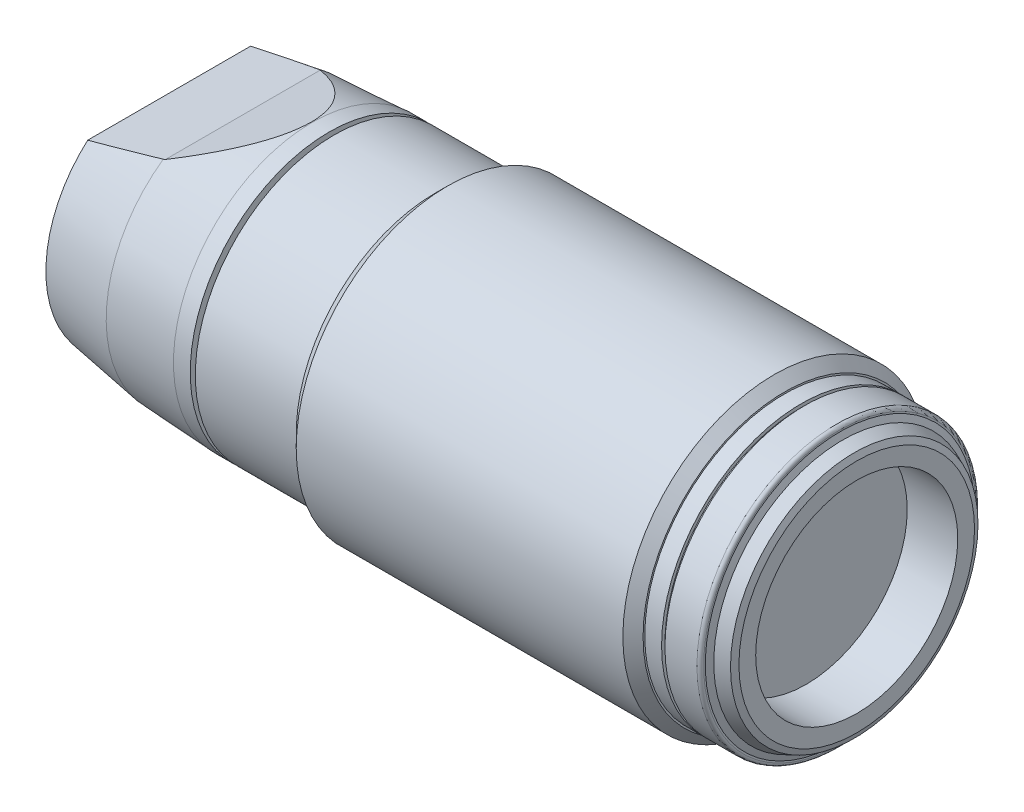
ISO-10303-21;
HEADER;
FILE_DESCRIPTION(('STEP AP214'),'2;1');
FILE_NAME('part.step','',(''),(''),'','','');
FILE_SCHEMA(('AUTOMOTIVE_DESIGN { 1 0 10303 214 1 1 1 1 }'));
ENDSEC;
DATA;
#1=APPLICATION_CONTEXT('core data for automotive mechanical design processes');
#2=APPLICATION_PROTOCOL_DEFINITION('international standard','automotive_design',2000,#1);
#3=PRODUCT_CONTEXT('',#1,'mechanical');
#4=PRODUCT('Part','Part','',(#3));
#5=PRODUCT_RELATED_PRODUCT_CATEGORY('part','',(#4));
#6=PRODUCT_DEFINITION_FORMATION('','',#4);
#7=PRODUCT_DEFINITION_CONTEXT('part definition',#1,'design');
#8=PRODUCT_DEFINITION('design','',#6,#7);
#9=PRODUCT_DEFINITION_SHAPE('','',#8);
#10=(LENGTH_UNIT() NAMED_UNIT(*) SI_UNIT(.MILLI.,.METRE.));
#11=(NAMED_UNIT(*) PLANE_ANGLE_UNIT() SI_UNIT($,.RADIAN.));
#12=(NAMED_UNIT(*) SI_UNIT($,.STERADIAN.) SOLID_ANGLE_UNIT());
#13=UNCERTAINTY_MEASURE_WITH_UNIT(LENGTH_MEASURE(1.E-05),#10,'distance_accuracy_value','');
#14=(GEOMETRIC_REPRESENTATION_CONTEXT(3) GLOBAL_UNCERTAINTY_ASSIGNED_CONTEXT((#13)) GLOBAL_UNIT_ASSIGNED_CONTEXT((#10,
#11,#12)) REPRESENTATION_CONTEXT('',''));
#15=CARTESIAN_POINT('',(0.,0.,0.));
#16=DIRECTION('',(0.,0.,1.));
#17=DIRECTION('',(1.,0.,0.));
#18=AXIS2_PLACEMENT_3D('',#15,#16,#17);
#19=CARTESIAN_POINT('',(-55.1010169868501,8.23905026673058,0.));
#20=DIRECTION('',(-1.,0.,0.));
#21=DIRECTION('',(0.,0.,1.));
#22=AXIS2_PLACEMENT_3D('',#19,#20,#21);
#23=PLANE('',#22);
#24=CARTESIAN_POINT('',(-55.1010169868501,0.,0.));
#25=DIRECTION('',(-1.,0.,0.));
#26=DIRECTION('',(0.,1.,0.));
#27=AXIS2_PLACEMENT_3D('',#24,#25,#26);
#28=CIRCLE('',#27,8.23340708161636);
#29=CARTESIAN_POINT('',(-55.1010169868501,8.23340708161636,0.));
#30=VERTEX_POINT('',#29);
#31=EDGE_CURVE('E174',#30,#30,#28,.T.);
#32=ORIENTED_EDGE('',*,*,#31,.F.);
#33=EDGE_LOOP('',(#32));
#34=FACE_BOUND('',#33,.T.);
#35=CARTESIAN_POINT('',(-55.1010169868501,0.,0.));
#36=DIRECTION('',(-1.,0.,0.));
#37=DIRECTION('',(0.,1.,0.));
#38=AXIS2_PLACEMENT_3D('',#35,#36,#37);
#39=CIRCLE('',#38,8.2446934518448);
#40=CARTESIAN_POINT('',(-55.1010169868501,8.2446934518448,0.));
#41=VERTEX_POINT('',#40);
#42=EDGE_CURVE('E206',#41,#41,#39,.T.);
#43=ORIENTED_EDGE('',*,*,#42,.T.);
#44=EDGE_LOOP('',(#43));
#45=FACE_BOUND('',#44,.T.);
#46=ADVANCED_FACE('F47',(#34,#45),#23,.T.);
#47=CARTESIAN_POINT('',(-54.1040542833416,7.84402730873667,0.));
#48=DIRECTION('',(1.,0.,0.));
#49=DIRECTION('',(0.,0.,1.));
#50=AXIS2_PLACEMENT_3D('',#47,#48,#49);
#51=PLANE('',#50);
#52=CARTESIAN_POINT('',(-54.1040542833416,0.,0.));
#53=DIRECTION('',(-1.,0.,0.));
#54=DIRECTION('',(0.,1.,0.));
#55=AXIS2_PLACEMENT_3D('',#52,#53,#54);
#56=CIRCLE('',#55,7.44336116562853);
#57=CARTESIAN_POINT('',(-54.1040542833416,7.44336116562853,0.));
#58=VERTEX_POINT('',#57);
#59=EDGE_CURVE('E173',#58,#58,#56,.T.);
#60=ORIENTED_EDGE('',*,*,#59,.T.);
#61=EDGE_LOOP('',(#60));
#62=FACE_BOUND('',#61,.T.);
#63=CARTESIAN_POINT('',(-54.1040542833416,0.,0.));
#64=DIRECTION('',(-1.,0.,0.));
#65=DIRECTION('',(0.,1.,0.));
#66=AXIS2_PLACEMENT_3D('',#63,#64,#65);
#67=CIRCLE('',#66,8.24469345184481);
#68=CARTESIAN_POINT('',(-54.1040542833416,8.24469345184481,0.));
#69=VERTEX_POINT('',#68);
#70=EDGE_CURVE('E193',#69,#69,#67,.T.);
#71=ORIENTED_EDGE('',*,*,#70,.F.);
#72=EDGE_LOOP('',(#71));
#73=FACE_BOUND('',#72,.T.);
#74=ADVANCED_FACE('F273',(#62,#73),#51,.T.);
#75=CARTESIAN_POINT('',(-53.8030844105843,7.84402730873668,0.));
#76=DIRECTION('',(-1.,0.,0.));
#77=DIRECTION('',(0.,0.,1.));
#78=AXIS2_PLACEMENT_3D('',#75,#76,#77);
#79=PLANE('',#78);
#80=CARTESIAN_POINT('',(-53.8030844105843,0.,0.));
#81=DIRECTION('',(-1.,0.,0.));
#82=DIRECTION('',(0.,1.,0.));
#83=AXIS2_PLACEMENT_3D('',#80,#81,#82);
#84=CIRCLE('',#83,7.44336116562856);
#85=CARTESIAN_POINT('',(-53.8030844105843,7.44336116562856,0.));
#86=VERTEX_POINT('',#85);
#87=EDGE_CURVE('E168',#86,#86,#84,.T.);
#88=ORIENTED_EDGE('',*,*,#87,.F.);
#89=EDGE_LOOP('',(#88));
#90=FACE_BOUND('',#89,.T.);
#91=CARTESIAN_POINT('',(-53.8030844105843,0.,0.));
#92=DIRECTION('',(-1.,0.,0.));
#93=DIRECTION('',(0.,1.,0.));
#94=AXIS2_PLACEMENT_3D('',#91,#92,#93);
#95=CIRCLE('',#94,8.24469345184481);
#96=CARTESIAN_POINT('',(-53.8030844105843,8.24469345184481,0.));
#97=VERTEX_POINT('',#96);
#98=EDGE_CURVE('E132',#97,#97,#95,.T.);
#99=ORIENTED_EDGE('',*,*,#98,.T.);
#100=EDGE_LOOP('',(#99));
#101=FACE_BOUND('',#100,.T.);
#102=ADVANCED_FACE('F279',(#90,#101),#79,.T.);
#103=CARTESIAN_POINT('',(-57.1622095161336,7.41087092652197,10.));
#104=DIRECTION('',(0.37845529282286,-0.925619571602915,0.));
#105=DIRECTION('',(0.,0.,-1.));
#106=AXIS2_PLACEMENT_3D('',#103,#104,#105);
#107=PLANE('',#106);
#108=CARTESIAN_POINT('',(-72.9605562151176,0.951448384572951,0.));
#109=DIRECTION('',(0.37845529282286,-0.925619571602915,0.));
#110=DIRECTION('',(-0.925619571602915,-0.37845529282286,0.));
#111=AXIS2_PLACEMENT_3D('',#108,#109,#110);
#112=ELLIPSE('',#111,19.2332325140927,7.21646745878138);
#113=CARTESIAN_POINT('',(-59.2273599823166,6.56649906103829,-4.59209156186527));
#114=VERTEX_POINT('',#113);
#115=CARTESIAN_POINT('',(-59.2273599823166,6.56649906103829,4.59209156186525));
#116=VERTEX_POINT('',#115);
#117=EDGE_CURVE('E109',#114,#116,#112,.T.);
#118=ORIENTED_EDGE('',*,*,#117,.F.);
#119=DIRECTION('',(0.,0.,-1.));
#120=VECTOR('',#119,1.);
#121=CARTESIAN_POINT('',(-59.2273599823166,6.56649906103829,10.));
#122=LINE('',#121,#120);
#123=EDGE_CURVE('E62',#116,#114,#122,.T.);
#124=ORIENTED_EDGE('',*,*,#123,.F.);
#125=EDGE_LOOP('',(#118,#124));
#126=FACE_BOUND('',#125,.T.);
#127=ADVANCED_FACE('F369',(#126),#107,.F.);
#128=CARTESIAN_POINT('',(-61.4136799911583,6.03081221244753,10.));
#129=DIRECTION('',(0.237978342728003,-0.971270460990363,0.));
#130=DIRECTION('',(0.,0.,-1.));
#131=AXIS2_PLACEMENT_3D('',#128,#129,#130);
#132=PLANE('',#131);
#133=CARTESIAN_POINT('',(-68.5403511127206,4.28465246519486,0.));
#134=DIRECTION('',(0.237978342728003,-0.971270460990363,0.));
#135=DIRECTION('',(-0.971270460990363,-0.237978342728003,0.));
#136=AXIS2_PLACEMENT_3D('',#133,#134,#135);
#137=ELLIPSE('',#136,27.4230416701056,4.92256072190537);
#138=CARTESIAN_POINT('',(-59.3329283602861,6.54063295201645,4.61908537341161));
#139=VERTEX_POINT('',#138);
#140=CARTESIAN_POINT('',(-63.6,5.49512536385674,4.83714268892134));
#141=VERTEX_POINT('',#140);
#142=EDGE_CURVE('E98',#139,#141,#137,.T.);
#143=ORIENTED_EDGE('',*,*,#142,.F.);
#144=CARTESIAN_POINT('',(-79.8765561836852,1.5070828757088,0.));
#145=DIRECTION('',(0.237978342728004,-0.971270460990363,0.));
#146=DIRECTION('',(-0.971270460990363,-0.237978342728004,0.));
#147=AXIS2_PLACEMENT_3D('',#144,#145,#146);
#148=ELLIPSE('',#147,29.0333087163899,6.74293034401905);
#149=EDGE_CURVE('E176',#116,#139,#148,.T.);
#150=ORIENTED_EDGE('',*,*,#149,.F.);
#151=ORIENTED_EDGE('',*,*,#123,.T.);
#152=CARTESIAN_POINT('',(-79.8765561836852,1.5070828757088,0.));
#153=DIRECTION('',(0.237978342728004,-0.971270460990363,0.));
#154=DIRECTION('',(-0.971270460990363,-0.237978342728004,0.));
#155=AXIS2_PLACEMENT_3D('',#152,#153,#154);
#156=ELLIPSE('',#155,29.0333087163899,6.74293034401905);
#157=CARTESIAN_POINT('',(-59.3329283602861,6.54063295201645,-4.61908537341163));
#158=VERTEX_POINT('',#157);
#159=EDGE_CURVE('E91',#158,#114,#156,.T.);
#160=ORIENTED_EDGE('',*,*,#159,.F.);
#161=CARTESIAN_POINT('',(-68.5403511127206,4.28465246519486,0.));
#162=DIRECTION('',(0.237978342728003,-0.971270460990363,0.));
#163=DIRECTION('',(-0.971270460990363,-0.237978342728003,0.));
#164=AXIS2_PLACEMENT_3D('',#161,#162,#163);
#165=ELLIPSE('',#164,27.4230416701056,4.92256072190537);
#166=CARTESIAN_POINT('',(-63.6,5.49512536385674,-4.83714268892136));
#167=VERTEX_POINT('',#166);
#168=EDGE_CURVE('E88',#167,#158,#165,.T.);
#169=ORIENTED_EDGE('',*,*,#168,.F.);
#170=DIRECTION('',(0.,0.,-1.));
#171=VECTOR('',#170,1.);
#172=CARTESIAN_POINT('',(-63.6,5.49512536385674,10.));
#173=LINE('',#172,#171);
#174=EDGE_CURVE('E77',#141,#167,#173,.T.);
#175=ORIENTED_EDGE('',*,*,#174,.F.);
#176=EDGE_LOOP('',(#143,#150,#151,#160,#169,#175));
#177=FACE_BOUND('',#176,.T.);
#178=ADVANCED_FACE('F89',(#177),#132,.F.);
#179=CARTESIAN_POINT('',(-63.6,2.74756268192837,10.));
#180=DIRECTION('',(1.,0.,0.));
#181=DIRECTION('',(0.,0.,1.));
#182=AXIS2_PLACEMENT_3D('',#179,#180,#181);
#183=PLANE('',#182);
#184=CARTESIAN_POINT('',(-63.6,0.,0.));
#185=DIRECTION('',(1.,0.,0.));
#186=DIRECTION('',(0.,1.,0.));
#187=AXIS2_PLACEMENT_3D('',#184,#185,#186);
#188=CIRCLE('',#187,7.32081635867797);
#189=EDGE_CURVE('E81',#141,#167,#188,.T.);
#190=ORIENTED_EDGE('',*,*,#189,.F.);
#191=ORIENTED_EDGE('',*,*,#174,.T.);
#192=EDGE_LOOP('',(#190,#191));
#193=FACE_BOUND('',#192,.T.);
#194=ADVANCED_FACE('F79',(#193),#183,.F.);
#195=CARTESIAN_POINT('',(-47.4356905400631,0.,0.));
#196=DIRECTION('',(1.,0.,0.));
#197=DIRECTION('',(0.,1.,0.));
#198=AXIS2_PLACEMENT_3D('',#195,#196,#197);
#199=CONICAL_SURFACE('',#198,8.61902473108667,0.785398163397409);
#200=CARTESIAN_POINT('',(-47.0613592608212,0.,0.));
#201=DIRECTION('',(1.,0.,0.));
#202=DIRECTION('',(0.,0.,-1.));
#203=AXIS2_PLACEMENT_3D('',#200,#201,#202);
#204=CIRCLE('',#203,8.99335601032853);
#205=CARTESIAN_POINT('',(-47.0613592608212,0.,-8.99335601032854));
#206=VERTEX_POINT('',#205);
#207=EDGE_CURVE('E221',#206,#206,#204,.T.);
#208=ORIENTED_EDGE('',*,*,#207,.F.);
#209=EDGE_LOOP('',(#208));
#210=FACE_BOUND('',#209,.T.);
#211=CARTESIAN_POINT('',(-47.810021819305,0.,0.));
#212=DIRECTION('',(-1.,0.,0.));
#213=DIRECTION('',(0.,1.,0.));
#214=AXIS2_PLACEMENT_3D('',#211,#212,#213);
#215=CIRCLE('',#214,8.24469345184481);
#216=CARTESIAN_POINT('',(-47.810021819305,8.24469345184481,0.));
#217=VERTEX_POINT('',#216);
#218=EDGE_CURVE('E86',#217,#217,#215,.T.);
#219=ORIENTED_EDGE('',*,*,#218,.F.);
#220=EDGE_LOOP('',(#219));
#221=FACE_BOUND('',#220,.T.);
#222=ADVANCED_FACE('F378',(#210,#221),#199,.T.);
#223=CARTESIAN_POINT('',(-50.8065531149446,0.,0.));
#224=DIRECTION('',(-1.,0.,0.));
#225=DIRECTION('',(0.,1.,0.));
#226=AXIS2_PLACEMENT_3D('',#223,#224,#225);
#227=CYLINDRICAL_SURFACE('',#226,8.24469345184481);
#228=ORIENTED_EDGE('',*,*,#218,.T.);
#229=EDGE_LOOP('',(#228));
#230=FACE_BOUND('',#229,.T.);
#231=ORIENTED_EDGE('',*,*,#98,.F.);
#232=EDGE_LOOP('',(#231));
#233=FACE_BOUND('',#232,.T.);
#234=ADVANCED_FACE('F286',(#230,#233),#227,.T.);
#235=CARTESIAN_POINT('',(-53.953569346963,0.,0.));
#236=DIRECTION('',(-1.,0.,0.));
#237=DIRECTION('',(0.,1.,0.));
#238=AXIS2_PLACEMENT_3D('',#235,#236,#237);
#239=CYLINDRICAL_SURFACE('',#238,7.44336116562855);
#240=ORIENTED_EDGE('',*,*,#87,.T.);
#241=EDGE_LOOP('',(#240));
#242=FACE_BOUND('',#241,.T.);
#243=ORIENTED_EDGE('',*,*,#59,.F.);
#244=EDGE_LOOP('',(#243));
#245=FACE_BOUND('',#244,.T.);
#246=ADVANCED_FACE('F365',(#242,#245),#239,.T.);
#247=CARTESIAN_POINT('',(-54.6025356350959,0.,0.));
#248=DIRECTION('',(-1.,0.,0.));
#249=DIRECTION('',(0.,1.,0.));
#250=AXIS2_PLACEMENT_3D('',#247,#248,#249);
#251=CYLINDRICAL_SURFACE('',#250,8.2446934518448);
#252=ORIENTED_EDGE('',*,*,#70,.T.);
#253=EDGE_LOOP('',(#252));
#254=FACE_BOUND('',#253,.T.);
#255=ORIENTED_EDGE('',*,*,#42,.F.);
#256=EDGE_LOOP('',(#255));
#257=FACE_BOUND('',#256,.T.);
#258=ADVANCED_FACE('F360',(#254,#257),#251,.T.);
#259=CARTESIAN_POINT('',(-57.2169726735681,0.,0.));
#260=DIRECTION('',(1.,0.,0.));
#261=DIRECTION('',(0.,1.,0.));
#262=AXIS2_PLACEMENT_3D('',#259,#260,#261);
#263=CONICAL_SURFACE('',#262,8.12032156391767,0.0533933836925066);
#264=ORIENTED_EDGE('',*,*,#31,.T.);
#265=EDGE_LOOP('',(#264));
#266=FACE_BOUND('',#265,.T.);
#267=CARTESIAN_POINT('',(-59.3329283602861,0.,0.));
#268=DIRECTION('',(-1.,0.,0.));
#269=DIRECTION('',(0.,1.,0.));
#270=AXIS2_PLACEMENT_3D('',#267,#268,#269);
#271=CIRCLE('',#270,8.00723604621898);
#272=EDGE_CURVE('E104',#158,#139,#271,.T.);
#273=ORIENTED_EDGE('',*,*,#272,.F.);
#274=ORIENTED_EDGE('',*,*,#159,.T.);
#275=ORIENTED_EDGE('',*,*,#117,.T.);
#276=ORIENTED_EDGE('',*,*,#149,.T.);
#277=EDGE_LOOP('',(#273,#274,#275,#276));
#278=FACE_BOUND('',#277,.T.);
#279=ADVANCED_FACE('F358',(#266,#278),#263,.T.);
#280=CARTESIAN_POINT('',(-61.4664751275351,0.,0.));
#281=DIRECTION('',(1.,0.,0.));
#282=DIRECTION('',(0.,1.,0.));
#283=AXIS2_PLACEMENT_3D('',#280,#281,#282);
#284=CONICAL_SURFACE('',#283,7.66402444140342,0.159497919165924);
#285=ORIENTED_EDGE('',*,*,#272,.T.);
#286=ORIENTED_EDGE('',*,*,#142,.T.);
#287=ORIENTED_EDGE('',*,*,#189,.T.);
#288=ORIENTED_EDGE('',*,*,#168,.T.);
#289=EDGE_LOOP('',(#285,#286,#287,#288));
#290=FACE_BOUND('',#289,.T.);
#291=ADVANCED_FACE('F97',(#290),#284,.T.);
#292=CARTESIAN_POINT('',(-27.0613592608212,0.,0.));
#293=DIRECTION('',(-1.,0.,0.));
#294=DIRECTION('',(0.,0.,1.));
#295=AXIS2_PLACEMENT_3D('',#292,#293,#294);
#296=CYLINDRICAL_SURFACE('',#295,8.99335601032853);
#297=CARTESIAN_POINT('',(-27.6632990063358,0.,0.));
#298=DIRECTION('',(1.,0.,0.));
#299=DIRECTION('',(0.,0.,-1.));
#300=AXIS2_PLACEMENT_3D('',#297,#298,#299);
#301=CIRCLE('',#300,8.99335601032853);
#302=CARTESIAN_POINT('',(-27.6632990063358,0.,-8.99335601032853));
#303=VERTEX_POINT('',#302);
#304=EDGE_CURVE('E310',#303,#303,#301,.F.);
#305=ORIENTED_EDGE('',*,*,#304,.T.);
#306=EDGE_LOOP('',(#305));
#307=FACE_BOUND('',#306,.T.);
#308=ORIENTED_EDGE('',*,*,#207,.T.);
#309=EDGE_LOOP('',(#308));
#310=FACE_BOUND('',#309,.T.);
#311=ADVANCED_FACE('F353',(#307,#310),#296,.T.);
#312=CARTESIAN_POINT('',(-27.0613592608212,0.,0.));
#313=DIRECTION('',(1.,0.,0.));
#314=DIRECTION('',(0.,0.,-1.));
#315=AXIS2_PLACEMENT_3D('',#312,#313,#314);
#316=PLANE('',#315);
#317=CARTESIAN_POINT('',(-27.0613592608212,0.,0.));
#318=DIRECTION('',(1.,0.,0.));
#319=DIRECTION('',(0.,0.,-1.));
#320=AXIS2_PLACEMENT_3D('',#317,#318,#319);
#321=CIRCLE('',#320,8.39517838822345);
#322=CARTESIAN_POINT('',(-27.0613592608212,0.,-8.39517838822345));
#323=VERTEX_POINT('',#322);
#324=EDGE_CURVE('E208',#323,#323,#321,.T.);
#325=ORIENTED_EDGE('',*,*,#324,.T.);
#326=EDGE_LOOP('',(#325));
#327=FACE_BOUND('',#326,.T.);
#328=CARTESIAN_POINT('',(-27.0613592608212,0.,0.));
#329=DIRECTION('',(1.,0.,0.));
#330=DIRECTION('',(0.,0.,-1.));
#331=AXIS2_PLACEMENT_3D('',#328,#329,#330);
#332=CIRCLE('',#331,8.29360105616787);
#333=CARTESIAN_POINT('',(-27.0613592608212,0.,-8.29360105616787));
#334=VERTEX_POINT('',#333);
#335=EDGE_CURVE('E227',#334,#334,#332,.T.);
#336=ORIENTED_EDGE('',*,*,#335,.F.);
#337=EDGE_LOOP('',(#336));
#338=FACE_BOUND('',#337,.T.);
#339=ADVANCED_FACE('F349',(#327,#338),#316,.T.);
#340=CARTESIAN_POINT('',(-26.0643965573127,0.,0.));
#341=DIRECTION('',(-1.,0.,0.));
#342=DIRECTION('',(0.,0.,1.));
#343=AXIS2_PLACEMENT_3D('',#340,#341,#342);
#344=CYLINDRICAL_SURFACE('',#343,8.29360105616787);
#345=CARTESIAN_POINT('',(-26.0643965573127,0.,0.));
#346=DIRECTION('',(1.,0.,0.));
#347=DIRECTION('',(0.,0.,-1.));
#348=AXIS2_PLACEMENT_3D('',#345,#346,#347);
#349=CIRCLE('',#348,8.29360105616787);
#350=CARTESIAN_POINT('',(-26.0643965573127,0.,-8.29360105616787));
#351=VERTEX_POINT('',#350);
#352=EDGE_CURVE('E226',#351,#351,#349,.T.);
#353=ORIENTED_EDGE('',*,*,#352,.F.);
#354=EDGE_LOOP('',(#353));
#355=FACE_BOUND('',#354,.T.);
#356=ORIENTED_EDGE('',*,*,#335,.T.);
#357=EDGE_LOOP('',(#356));
#358=FACE_BOUND('',#357,.T.);
#359=ADVANCED_FACE('F345',(#355,#358),#344,.T.);
#360=CARTESIAN_POINT('',(-26.0643965573127,0.,0.));
#361=DIRECTION('',(1.,0.,0.));
#362=DIRECTION('',(0.,0.,-1.));
#363=AXIS2_PLACEMENT_3D('',#360,#361,#362);
#364=PLANE('',#363);
#365=CARTESIAN_POINT('',(-26.0643965573127,0.,0.));
#366=DIRECTION('',(1.,0.,0.));
#367=DIRECTION('',(0.,0.,-1.));
#368=AXIS2_PLACEMENT_3D('',#365,#366,#367);
#369=CIRCLE('',#368,8.09420851546615);
#370=CARTESIAN_POINT('',(-26.0643965573127,0.,-8.09420851546615));
#371=VERTEX_POINT('',#370);
#372=EDGE_CURVE('E230',#371,#371,#369,.T.);
#373=ORIENTED_EDGE('',*,*,#372,.F.);
#374=EDGE_LOOP('',(#373));
#375=FACE_BOUND('',#374,.T.);
#376=ORIENTED_EDGE('',*,*,#352,.T.);
#377=EDGE_LOOP('',(#376));
#378=FACE_BOUND('',#377,.T.);
#379=ADVANCED_FACE('F341',(#375,#378),#364,.T.);
#380=CARTESIAN_POINT('',(-25.865004016611,0.,0.));
#381=DIRECTION('',(-1.,0.,0.));
#382=DIRECTION('',(0.,0.,1.));
#383=AXIS2_PLACEMENT_3D('',#380,#381,#382);
#384=CYLINDRICAL_SURFACE('',#383,8.09420851546615);
#385=CARTESIAN_POINT('',(-25.865004016611,0.,0.));
#386=DIRECTION('',(1.,0.,0.));
#387=DIRECTION('',(0.,0.,-1.));
#388=AXIS2_PLACEMENT_3D('',#385,#386,#387);
#389=CIRCLE('',#388,8.09420851546615);
#390=CARTESIAN_POINT('',(-25.865004016611,0.,-8.09420851546615));
#391=VERTEX_POINT('',#390);
#392=EDGE_CURVE('E233',#391,#391,#389,.T.);
#393=ORIENTED_EDGE('',*,*,#392,.F.);
#394=EDGE_LOOP('',(#393));
#395=FACE_BOUND('',#394,.T.);
#396=ORIENTED_EDGE('',*,*,#372,.T.);
#397=EDGE_LOOP('',(#396));
#398=FACE_BOUND('',#397,.T.);
#399=ADVANCED_FACE('F322',(#395,#398),#384,.T.);
#400=CARTESIAN_POINT('',(-23.765739154129,0.,0.));
#401=DIRECTION('',(-1.,0.,0.));
#402=DIRECTION('',(0.,0.,1.));
#403=AXIS2_PLACEMENT_3D('',#400,#401,#402);
#404=CYLINDRICAL_SURFACE('',#403,8.29360105616787);
#405=CARTESIAN_POINT('',(-23.9647899774355,0.,0.));
#406=DIRECTION('',(1.,0.,0.));
#407=DIRECTION('',(0.,0.,-1.));
#408=AXIS2_PLACEMENT_3D('',#405,#406,#407);
#409=CIRCLE('',#408,8.29360105616787);
#410=CARTESIAN_POINT('',(-23.9647899774355,0.,-8.29360105616787));
#411=VERTEX_POINT('',#410);
#412=EDGE_CURVE('E56',#411,#411,#409,.F.);
#413=ORIENTED_EDGE('',*,*,#412,.T.);
#414=EDGE_LOOP('',(#413));
#415=FACE_BOUND('',#414,.T.);
#416=CARTESIAN_POINT('',(-25.865004016611,0.,0.));
#417=DIRECTION('',(-1.,0.,0.));
#418=DIRECTION('',(0.,0.,-1.));
#419=AXIS2_PLACEMENT_3D('',#416,#417,#418);
#420=CIRCLE('',#419,8.29360105616787);
#421=CARTESIAN_POINT('',(-25.865004016611,0.,-8.29360105616787));
#422=VERTEX_POINT('',#421);
#423=EDGE_CURVE('E239',#422,#422,#420,.T.);
#424=ORIENTED_EDGE('',*,*,#423,.F.);
#425=EDGE_LOOP('',(#424));
#426=FACE_BOUND('',#425,.T.);
#427=ADVANCED_FACE('F317',(#415,#426),#404,.T.);
#428=CARTESIAN_POINT('',(-23.765739154129,0.,0.));
#429=DIRECTION('',(1.,0.,0.));
#430=DIRECTION('',(0.,0.,-1.));
#431=AXIS2_PLACEMENT_3D('',#428,#429,#430);
#432=PLANE('',#431);
#433=CARTESIAN_POINT('',(-23.765739154129,0.,0.));
#434=DIRECTION('',(1.,0.,0.));
#435=DIRECTION('',(0.,0.,-1.));
#436=AXIS2_PLACEMENT_3D('',#433,#434,#435);
#437=CIRCLE('',#436,8.09455023286132);
#438=CARTESIAN_POINT('',(-23.765739154129,0.,-8.09455023286133));
#439=VERTEX_POINT('',#438);
#440=EDGE_CURVE('E13',#439,#439,#437,.T.);
#441=ORIENTED_EDGE('',*,*,#440,.T.);
#442=EDGE_LOOP('',(#441));
#443=FACE_BOUND('',#442,.T.);
#444=CARTESIAN_POINT('',(-23.765739154129,0.,0.));
#445=DIRECTION('',(1.,0.,0.));
#446=DIRECTION('',(0.,0.,-1.));
#447=AXIS2_PLACEMENT_3D('',#444,#445,#446);
#448=CIRCLE('',#447,7.99639330682005);
#449=CARTESIAN_POINT('',(-23.765739154129,0.,-7.99639330682005));
#450=VERTEX_POINT('',#449);
#451=EDGE_CURVE('E236',#450,#450,#448,.T.);
#452=ORIENTED_EDGE('',*,*,#451,.F.);
#453=EDGE_LOOP('',(#452));
#454=FACE_BOUND('',#453,.T.);
#455=ADVANCED_FACE('F321',(#443,#454),#432,.T.);
#456=CARTESIAN_POINT('',(-25.865004016611,0.,0.));
#457=DIRECTION('',(1.,0.,0.));
#458=DIRECTION('',(0.,0.,-1.));
#459=AXIS2_PLACEMENT_3D('',#456,#457,#458);
#460=PLANE('',#459);
#461=ORIENTED_EDGE('',*,*,#392,.T.);
#462=EDGE_LOOP('',(#461));
#463=FACE_BOUND('',#462,.T.);
#464=ORIENTED_EDGE('',*,*,#423,.T.);
#465=EDGE_LOOP('',(#464));
#466=FACE_BOUND('',#465,.T.);
#467=ADVANCED_FACE('F326',(#463,#466),#460,.F.);
#468=CARTESIAN_POINT('',(-23.765739154129,0.,0.));
#469=DIRECTION('',(-1.,0.,0.));
#470=DIRECTION('',(0.,0.,-1.));
#471=AXIS2_PLACEMENT_3D('',#468,#469,#470);
#472=CONICAL_SURFACE('',#471,7.99639330682005,1.17751692174108);
#473=CARTESIAN_POINT('',(-23.618234086928,0.,0.));
#474=DIRECTION('',(1.,0.,0.));
#475=DIRECTION('',(0.,0.,-1.));
#476=AXIS2_PLACEMENT_3D('',#473,#474,#475);
#477=CIRCLE('',#476,7.64086827305347);
#478=CARTESIAN_POINT('',(-23.618234086928,0.,-7.64086827305347));
#479=VERTEX_POINT('',#478);
#480=EDGE_CURVE('E242',#479,#479,#477,.T.);
#481=ORIENTED_EDGE('',*,*,#480,.F.);
#482=EDGE_LOOP('',(#481));
#483=FACE_BOUND('',#482,.T.);
#484=ORIENTED_EDGE('',*,*,#451,.T.);
#485=EDGE_LOOP('',(#484));
#486=FACE_BOUND('',#485,.T.);
#487=ADVANCED_FACE('F268',(#483,#486),#472,.T.);
#488=CARTESIAN_POINT('',(-23.618234086928,0.,0.));
#489=DIRECTION('',(-1.,0.,0.));
#490=DIRECTION('',(0.,0.,-1.));
#491=AXIS2_PLACEMENT_3D('',#488,#489,#490);
#492=CONICAL_SURFACE('',#491,7.6408682730535,0.393279405053867);
#493=CARTESIAN_POINT('',(-22.9154992635896,0.,0.));
#494=DIRECTION('',(-1.,0.,0.));
#495=DIRECTION('',(0.,0.,1.));
#496=AXIS2_PLACEMENT_3D('',#493,#494,#495);
#497=CIRCLE('',#496,7.34930808039188);
#498=CARTESIAN_POINT('',(-22.9154992635896,0.,7.34930808039188));
#499=VERTEX_POINT('',#498);
#500=EDGE_CURVE('E307',#499,#499,#497,.T.);
#501=ORIENTED_EDGE('',*,*,#500,.T.);
#502=EDGE_LOOP('',(#501));
#503=FACE_BOUND('',#502,.T.);
#504=ORIENTED_EDGE('',*,*,#480,.T.);
#505=EDGE_LOOP('',(#504));
#506=FACE_BOUND('',#505,.T.);
#507=ADVANCED_FACE('F259',(#503,#506),#492,.T.);
#508=CARTESIAN_POINT('',(-22.7687764506205,0.,0.));
#509=DIRECTION('',(1.,0.,0.));
#510=DIRECTION('',(0.,0.,-1.));
#511=AXIS2_PLACEMENT_3D('',#508,#509,#510);
#512=PLANE('',#511);
#513=CARTESIAN_POINT('',(-22.7687764506205,0.,0.));
#514=DIRECTION('',(1.,0.,0.));
#515=DIRECTION('',(0.,0.,-1.));
#516=AXIS2_PLACEMENT_3D('',#513,#514,#515);
#517=CIRCLE('',#516,6.9956684799021);
#518=CARTESIAN_POINT('',(-22.7687764506205,0.,-6.9956684799021));
#519=VERTEX_POINT('',#518);
#520=EDGE_CURVE('E309',#519,#519,#517,.T.);
#521=ORIENTED_EDGE('',*,*,#520,.T.);
#522=EDGE_LOOP('',(#521));
#523=FACE_BOUND('',#522,.T.);
#524=CARTESIAN_POINT('',(-22.7687764506205,0.,0.));
#525=DIRECTION('',(1.,0.,0.));
#526=DIRECTION('',(0.,0.,-1.));
#527=AXIS2_PLACEMENT_3D('',#524,#525,#526);
#528=CIRCLE('',#527,5.99999999999999);
#529=CARTESIAN_POINT('',(-22.7687764506205,0.,-5.99999999999999));
#530=VERTEX_POINT('',#529);
#531=EDGE_CURVE('E250',#530,#530,#528,.T.);
#532=ORIENTED_EDGE('',*,*,#531,.F.);
#533=EDGE_LOOP('',(#532));
#534=FACE_BOUND('',#533,.T.);
#535=ADVANCED_FACE('F256',(#523,#534),#512,.T.);
#536=CARTESIAN_POINT('',(-25.7687764506205,0.,0.));
#537=DIRECTION('',(-1.,0.,0.));
#538=DIRECTION('',(0.,0.,1.));
#539=AXIS2_PLACEMENT_3D('',#536,#537,#538);
#540=PLANE('',#539);
#541=CARTESIAN_POINT('',(-25.7687764506205,0.,0.));
#542=DIRECTION('',(1.,0.,0.));
#543=DIRECTION('',(0.,0.,-1.));
#544=AXIS2_PLACEMENT_3D('',#541,#542,#543);
#545=CIRCLE('',#544,5.99999999999999);
#546=CARTESIAN_POINT('',(-25.7687764506205,0.,-5.99999999999999));
#547=VERTEX_POINT('',#546);
#548=EDGE_CURVE('E245',#547,#547,#545,.T.);
#549=ORIENTED_EDGE('',*,*,#548,.T.);
#550=EDGE_LOOP('',(#549));
#551=FACE_BOUND('',#550,.T.);
#552=ADVANCED_FACE('F258',(#551),#540,.F.);
#553=CARTESIAN_POINT('',(-22.7687764506205,0.,0.));
#554=DIRECTION('',(1.,0.,0.));
#555=DIRECTION('',(0.,0.,-1.));
#556=AXIS2_PLACEMENT_3D('',#553,#554,#555);
#557=CYLINDRICAL_SURFACE('',#556,5.99999999999999);
#558=ORIENTED_EDGE('',*,*,#548,.F.);
#559=EDGE_LOOP('',(#558));
#560=FACE_BOUND('',#559,.T.);
#561=ORIENTED_EDGE('',*,*,#531,.T.);
#562=EDGE_LOOP('',(#561));
#563=FACE_BOUND('',#562,.T.);
#564=ADVANCED_FACE('F254',(#560,#563),#557,.F.);
#565=CARTESIAN_POINT('',(-27.0613592608212,0.,0.));
#566=DIRECTION('',(-1.,0.,0.));
#567=DIRECTION('',(0.,0.,1.));
#568=AXIS2_PLACEMENT_3D('',#565,#566,#567);
#569=CONICAL_SURFACE('',#568,8.39517838822345,0.782263377427636);
#570=ORIENTED_EDGE('',*,*,#304,.F.);
#571=EDGE_LOOP('',(#570));
#572=FACE_BOUND('',#571,.T.);
#573=ORIENTED_EDGE('',*,*,#324,.F.);
#574=EDGE_LOOP('',(#573));
#575=FACE_BOUND('',#574,.T.);
#576=ADVANCED_FACE('F289',(#572,#575),#569,.T.);
#577=CARTESIAN_POINT('',(-22.7687764506205,0.,0.));
#578=DIRECTION('',(-1.,0.,0.));
#579=DIRECTION('',(0.,0.,1.));
#580=AXIS2_PLACEMENT_3D('',#577,#578,#579);
#581=CONICAL_SURFACE('',#580,6.9956684799021,1.17751692174096);
#582=ORIENTED_EDGE('',*,*,#500,.F.);
#583=EDGE_LOOP('',(#582));
#584=FACE_BOUND('',#583,.T.);
#585=ORIENTED_EDGE('',*,*,#520,.F.);
#586=EDGE_LOOP('',(#585));
#587=FACE_BOUND('',#586,.T.);
#588=ADVANCED_FACE('F294',(#584,#587),#581,.T.);
#589=CARTESIAN_POINT('',(-23.9647899774355,0.,0.));
#590=DIRECTION('',(1.,0.,0.));
#591=DIRECTION('',(0.,0.,-1.));
#592=AXIS2_PLACEMENT_3D('',#589,#590,#591);
#593=TOROIDAL_SURFACE('',#592,8.09455023286132,0.199050823306545);
#594=ORIENTED_EDGE('',*,*,#440,.F.);
#595=EDGE_LOOP('',(#594));
#596=FACE_BOUND('',#595,.T.);
#597=ORIENTED_EDGE('',*,*,#412,.F.);
#598=EDGE_LOOP('',(#597));
#599=FACE_BOUND('',#598,.T.);
#600=ADVANCED_FACE('F49',(#596,#599),#593,.T.);
#601=CLOSED_SHELL('',(#46,#74,#102,#127,#178,#194,#222,#234,#246,#258,#279,#291,#311,#339,#359,
#379,#399,#427,#455,#467,#487,#507,#535,#552,#564,#576,#588,#600));
#602=MANIFOLD_SOLID_BREP('B2',#601);
#603=ADVANCED_BREP_SHAPE_REPRESENTATION('',(#18,#602),#14);
#604=SHAPE_DEFINITION_REPRESENTATION(#9,#603);
ENDSEC;
END-ISO-10303-21;
